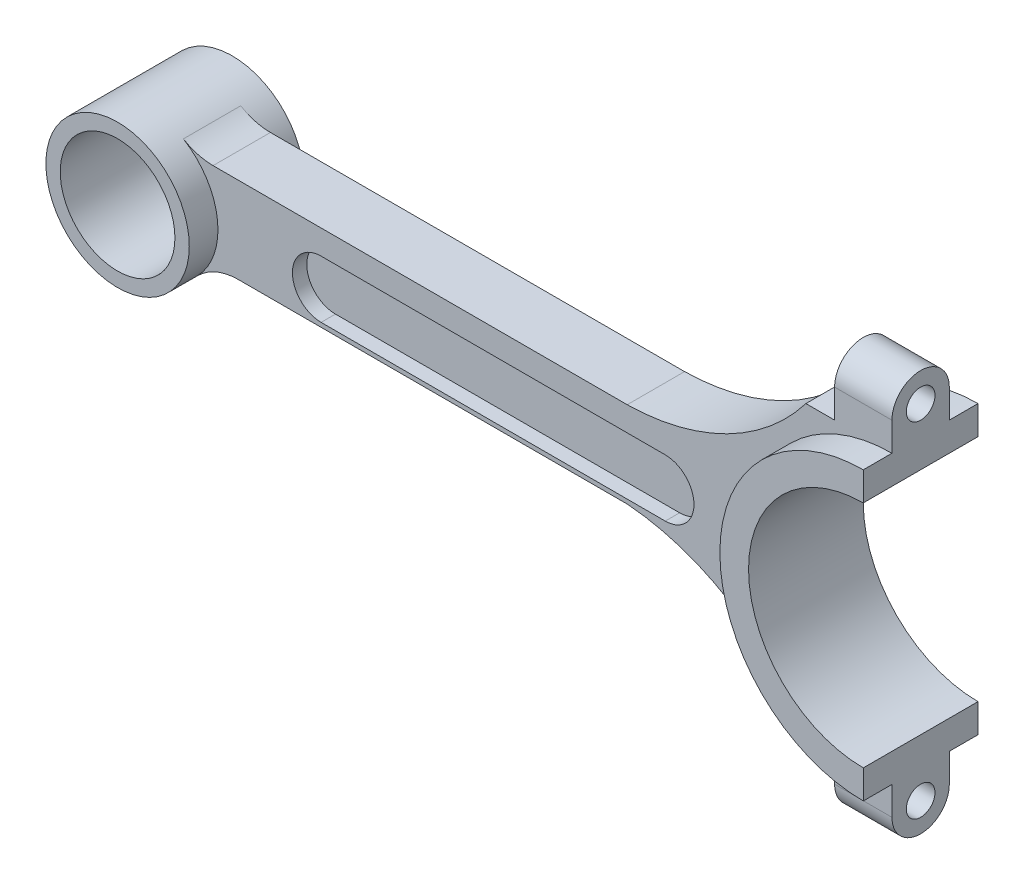
ISO-10303-21;
HEADER;
FILE_DESCRIPTION(('STEP AP214'),'2;1');
FILE_NAME('part.step','',(''),(''),'','','');
FILE_SCHEMA(('AUTOMOTIVE_DESIGN { 1 0 10303 214 1 1 1 1 }'));
ENDSEC;
DATA;
#1=APPLICATION_CONTEXT('core data for automotive mechanical design processes');
#2=APPLICATION_PROTOCOL_DEFINITION('international standard','automotive_design',2000,#1);
#3=PRODUCT_CONTEXT('',#1,'mechanical');
#4=PRODUCT('Part','Part','',(#3));
#5=PRODUCT_RELATED_PRODUCT_CATEGORY('part','',(#4));
#6=PRODUCT_DEFINITION_FORMATION('','',#4);
#7=PRODUCT_DEFINITION_CONTEXT('part definition',#1,'design');
#8=PRODUCT_DEFINITION('design','',#6,#7);
#9=PRODUCT_DEFINITION_SHAPE('','',#8);
#10=(LENGTH_UNIT() NAMED_UNIT(*) SI_UNIT(.MILLI.,.METRE.));
#11=(NAMED_UNIT(*) PLANE_ANGLE_UNIT() SI_UNIT($,.RADIAN.));
#12=(NAMED_UNIT(*) SI_UNIT($,.STERADIAN.) SOLID_ANGLE_UNIT());
#13=UNCERTAINTY_MEASURE_WITH_UNIT(LENGTH_MEASURE(1.E-05),#10,'distance_accuracy_value','');
#14=(GEOMETRIC_REPRESENTATION_CONTEXT(3) GLOBAL_UNCERTAINTY_ASSIGNED_CONTEXT((#13)) GLOBAL_UNIT_ASSIGNED_CONTEXT((#10,
#11,#12)) REPRESENTATION_CONTEXT('',''));
#15=CARTESIAN_POINT('',(0.,0.,0.));
#16=DIRECTION('',(0.,0.,1.));
#17=DIRECTION('',(1.,0.,0.));
#18=AXIS2_PLACEMENT_3D('',#15,#16,#17);
#19=CARTESIAN_POINT('',(0.,-31.7499999999999,6.35));
#20=DIRECTION('',(0.,-1.,0.));
#21=DIRECTION('',(1.,0.,0.));
#22=AXIS2_PLACEMENT_3D('',#19,#20,#21);
#23=PLANE('',#22);
#24=DIRECTION('',(-1.,0.,0.));
#25=VECTOR('',#24,1.);
#26=CARTESIAN_POINT('',(0.,-31.7499999999999,-6.35));
#27=LINE('',#26,#25);
#28=CARTESIAN_POINT('',(152.4,-31.75,-6.35));
#29=VERTEX_POINT('',#28);
#30=CARTESIAN_POINT('',(146.05,-31.75,-6.35));
#31=VERTEX_POINT('',#30);
#32=EDGE_CURVE('E423',#29,#31,#27,.T.);
#33=ORIENTED_EDGE('',*,*,#32,.F.);
#34=DIRECTION('',(0.,0.,-1.));
#35=VECTOR('',#34,1.);
#36=CARTESIAN_POINT('',(152.4,-31.75,0.));
#37=LINE('',#36,#35);
#38=CARTESIAN_POINT('',(152.4,-31.75,6.35));
#39=VERTEX_POINT('',#38);
#40=EDGE_CURVE('E233',#39,#29,#37,.T.);
#41=ORIENTED_EDGE('',*,*,#40,.F.);
#42=DIRECTION('',(-1.,0.,0.));
#43=VECTOR('',#42,1.);
#44=CARTESIAN_POINT('',(0.,-31.7499999999999,6.35));
#45=LINE('',#44,#43);
#46=CARTESIAN_POINT('',(146.05,-31.75,6.35));
#47=VERTEX_POINT('',#46);
#48=EDGE_CURVE('E248',#39,#47,#45,.T.);
#49=ORIENTED_EDGE('',*,*,#48,.T.);
#50=DIRECTION('',(0.,0.,-1.));
#51=VECTOR('',#50,1.);
#52=CARTESIAN_POINT('',(146.05,-31.75,6.35));
#53=LINE('',#52,#51);
#54=EDGE_CURVE('E397',#47,#31,#53,.T.);
#55=ORIENTED_EDGE('',*,*,#54,.T.);
#56=EDGE_LOOP('',(#33,#41,#49,#55));
#57=FACE_BOUND('',#56,.T.);
#58=ADVANCED_FACE('F36',(#57),#23,.T.);
#59=CARTESIAN_POINT('',(0.,31.7500000000001,6.35));
#60=DIRECTION('',(0.,1.,0.));
#61=DIRECTION('',(-1.,0.,0.));
#62=AXIS2_PLACEMENT_3D('',#59,#60,#61);
#63=PLANE('',#62);
#64=DIRECTION('',(1.,0.,0.));
#65=VECTOR('',#64,1.);
#66=CARTESIAN_POINT('',(0.,31.7500000000001,6.35));
#67=LINE('',#66,#65);
#68=CARTESIAN_POINT('',(146.05,31.75,6.35));
#69=VERTEX_POINT('',#68);
#70=CARTESIAN_POINT('',(152.4,31.75,6.35));
#71=VERTEX_POINT('',#70);
#72=EDGE_CURVE('E53',#69,#71,#67,.T.);
#73=ORIENTED_EDGE('',*,*,#72,.T.);
#74=DIRECTION('',(0.,0.,1.));
#75=VECTOR('',#74,1.);
#76=CARTESIAN_POINT('',(152.4,31.75,0.));
#77=LINE('',#76,#75);
#78=CARTESIAN_POINT('',(152.4,31.75,-6.35));
#79=VERTEX_POINT('',#78);
#80=EDGE_CURVE('E58',#79,#71,#77,.T.);
#81=ORIENTED_EDGE('',*,*,#80,.F.);
#82=DIRECTION('',(1.,0.,0.));
#83=VECTOR('',#82,1.);
#84=CARTESIAN_POINT('',(0.,31.7500000000001,-6.35));
#85=LINE('',#84,#83);
#86=CARTESIAN_POINT('',(146.05,31.75,-6.35));
#87=VERTEX_POINT('',#86);
#88=EDGE_CURVE('E400',#87,#79,#85,.T.);
#89=ORIENTED_EDGE('',*,*,#88,.F.);
#90=DIRECTION('',(0.,0.,-1.));
#91=VECTOR('',#90,1.);
#92=CARTESIAN_POINT('',(146.05,31.75,6.35));
#93=LINE('',#92,#91);
#94=EDGE_CURVE('E40',#69,#87,#93,.T.);
#95=ORIENTED_EDGE('',*,*,#94,.F.);
#96=EDGE_LOOP('',(#73,#81,#89,#95));
#97=FACE_BOUND('',#96,.T.);
#98=ADVANCED_FACE('F38',(#97),#63,.T.);
#99=CARTESIAN_POINT('',(114.912408675452,0.,6.35));
#100=DIRECTION('',(0.,0.,-1.));
#101=DIRECTION('',(-1.,0.,0.));
#102=AXIS2_PLACEMENT_3D('',#99,#100,#101);
#103=CYLINDRICAL_SURFACE('',#102,6.35);
#104=DIRECTION('',(0.,0.,-1.));
#105=VECTOR('',#104,1.);
#106=CARTESIAN_POINT('',(114.912408675452,-6.35,6.35));
#107=LINE('',#106,#105);
#108=CARTESIAN_POINT('',(114.912408675452,-6.35,-3.175));
#109=VERTEX_POINT('',#108);
#110=CARTESIAN_POINT('',(114.912408675452,-6.35,-6.35));
#111=VERTEX_POINT('',#110);
#112=EDGE_CURVE('E45',#109,#111,#107,.T.);
#113=ORIENTED_EDGE('',*,*,#112,.F.);
#114=CARTESIAN_POINT('',(114.912408675452,0.,-3.175));
#115=DIRECTION('',(0.,0.,1.));
#116=DIRECTION('',(1.,0.,0.));
#117=AXIS2_PLACEMENT_3D('',#114,#115,#116);
#118=CIRCLE('',#117,6.35);
#119=CARTESIAN_POINT('',(114.912408675452,6.35,-3.175));
#120=VERTEX_POINT('',#119);
#121=EDGE_CURVE('E307',#109,#120,#118,.T.);
#122=ORIENTED_EDGE('',*,*,#121,.T.);
#123=DIRECTION('',(0.,0.,-1.));
#124=VECTOR('',#123,1.);
#125=CARTESIAN_POINT('',(114.912408675452,6.35,6.35));
#126=LINE('',#125,#124);
#127=CARTESIAN_POINT('',(114.912408675452,6.35,-6.35));
#128=VERTEX_POINT('',#127);
#129=EDGE_CURVE('E440',#120,#128,#126,.T.);
#130=ORIENTED_EDGE('',*,*,#129,.T.);
#131=CARTESIAN_POINT('',(114.912408675452,0.,-6.35));
#132=DIRECTION('',(0.,0.,1.));
#133=DIRECTION('',(1.,0.,0.));
#134=AXIS2_PLACEMENT_3D('',#131,#132,#133);
#135=CIRCLE('',#134,6.35);
#136=EDGE_CURVE('E425',#111,#128,#135,.T.);
#137=ORIENTED_EDGE('',*,*,#136,.F.);
#138=EDGE_LOOP('',(#113,#122,#130,#137));
#139=FACE_BOUND('',#138,.T.);
#140=ADVANCED_FACE('F468',(#139),#103,.F.);
#141=CARTESIAN_POINT('',(0.,-6.35,6.35));
#142=DIRECTION('',(0.,1.,0.));
#143=DIRECTION('',(0.,0.,1.));
#144=AXIS2_PLACEMENT_3D('',#141,#142,#143);
#145=PLANE('',#144);
#146=DIRECTION('',(0.,0.,-1.));
#147=VECTOR('',#146,1.);
#148=CARTESIAN_POINT('',(38.7124086754516,-6.35,6.35));
#149=LINE('',#148,#147);
#150=CARTESIAN_POINT('',(38.7124086754516,-6.35,-3.175));
#151=VERTEX_POINT('',#150);
#152=CARTESIAN_POINT('',(38.7124086754516,-6.35,-6.35));
#153=VERTEX_POINT('',#152);
#154=EDGE_CURVE('E444',#151,#153,#149,.T.);
#155=ORIENTED_EDGE('',*,*,#154,.F.);
#156=DIRECTION('',(1.,0.,0.));
#157=VECTOR('',#156,1.);
#158=CARTESIAN_POINT('',(0.,-6.35,-3.175));
#159=LINE('',#158,#157);
#160=EDGE_CURVE('E293',#151,#109,#159,.T.);
#161=ORIENTED_EDGE('',*,*,#160,.T.);
#162=ORIENTED_EDGE('',*,*,#112,.T.);
#163=DIRECTION('',(1.,0.,0.));
#164=VECTOR('',#163,1.);
#165=CARTESIAN_POINT('',(0.,-6.35,-6.35));
#166=LINE('',#165,#164);
#167=EDGE_CURVE('E428',#153,#111,#166,.T.);
#168=ORIENTED_EDGE('',*,*,#167,.F.);
#169=EDGE_LOOP('',(#155,#161,#162,#168));
#170=FACE_BOUND('',#169,.T.);
#171=ADVANCED_FACE('F480',(#170),#145,.T.);
#172=CARTESIAN_POINT('',(38.7124086754516,0.,6.35));
#173=DIRECTION('',(0.,0.,-1.));
#174=DIRECTION('',(-1.,0.,0.));
#175=AXIS2_PLACEMENT_3D('',#172,#173,#174);
#176=CYLINDRICAL_SURFACE('',#175,6.35);
#177=DIRECTION('',(0.,0.,-1.));
#178=VECTOR('',#177,1.);
#179=CARTESIAN_POINT('',(38.7124086754516,6.35,6.35));
#180=LINE('',#179,#178);
#181=CARTESIAN_POINT('',(38.7124086754516,6.35,-3.175));
#182=VERTEX_POINT('',#181);
#183=CARTESIAN_POINT('',(38.7124086754516,6.35,-6.35));
#184=VERTEX_POINT('',#183);
#185=EDGE_CURVE('E439',#182,#184,#180,.T.);
#186=ORIENTED_EDGE('',*,*,#185,.F.);
#187=CARTESIAN_POINT('',(38.7124086754516,0.,-3.175));
#188=DIRECTION('',(0.,0.,1.));
#189=DIRECTION('',(1.,0.,0.));
#190=AXIS2_PLACEMENT_3D('',#187,#188,#189);
#191=CIRCLE('',#190,6.35);
#192=EDGE_CURVE('E298',#182,#151,#191,.T.);
#193=ORIENTED_EDGE('',*,*,#192,.T.);
#194=ORIENTED_EDGE('',*,*,#154,.T.);
#195=CARTESIAN_POINT('',(38.7124086754516,0.,-6.35));
#196=DIRECTION('',(0.,0.,1.));
#197=DIRECTION('',(1.,0.,0.));
#198=AXIS2_PLACEMENT_3D('',#195,#196,#197);
#199=CIRCLE('',#198,6.35);
#200=EDGE_CURVE('E431',#184,#153,#199,.T.);
#201=ORIENTED_EDGE('',*,*,#200,.F.);
#202=EDGE_LOOP('',(#186,#193,#194,#201));
#203=FACE_BOUND('',#202,.T.);
#204=ADVANCED_FACE('F486',(#203),#176,.F.);
#205=CARTESIAN_POINT('',(0.,6.35,6.35));
#206=DIRECTION('',(0.,1.,0.));
#207=DIRECTION('',(0.,0.,1.));
#208=AXIS2_PLACEMENT_3D('',#205,#206,#207);
#209=PLANE('',#208);
#210=DIRECTION('',(1.,0.,0.));
#211=VECTOR('',#210,1.);
#212=CARTESIAN_POINT('',(0.,6.35,-3.175));
#213=LINE('',#212,#211);
#214=EDGE_CURVE('E310',#182,#120,#213,.T.);
#215=ORIENTED_EDGE('',*,*,#214,.F.);
#216=ORIENTED_EDGE('',*,*,#185,.T.);
#217=DIRECTION('',(1.,0.,0.));
#218=VECTOR('',#217,1.);
#219=CARTESIAN_POINT('',(0.,6.35,-6.35));
#220=LINE('',#219,#218);
#221=EDGE_CURVE('E363',#184,#128,#220,.T.);
#222=ORIENTED_EDGE('',*,*,#221,.T.);
#223=ORIENTED_EDGE('',*,*,#129,.F.);
#224=EDGE_LOOP('',(#215,#216,#222,#223));
#225=FACE_BOUND('',#224,.T.);
#226=ADVANCED_FACE('F472',(#225),#209,.F.);
#227=CARTESIAN_POINT('',(114.912408675452,0.,3.175));
#228=DIRECTION('',(0.,0.,1.));
#229=DIRECTION('',(1.,0.,0.));
#230=AXIS2_PLACEMENT_3D('',#227,#228,#229);
#231=CIRCLE('',#230,6.35);
#232=CARTESIAN_POINT('',(114.912408675452,-6.35,3.175));
#233=VERTEX_POINT('',#232);
#234=CARTESIAN_POINT('',(114.912408675452,6.35,3.175));
#235=VERTEX_POINT('',#234);
#236=EDGE_CURVE('E297',#233,#235,#231,.T.);
#237=ORIENTED_EDGE('',*,*,#236,.F.);
#238=CARTESIAN_POINT('',(114.912408675452,-6.35,6.35));
#239=VERTEX_POINT('',#238);
#240=EDGE_CURVE('E11',#239,#233,#107,.T.);
#241=ORIENTED_EDGE('',*,*,#240,.F.);
#242=CARTESIAN_POINT('',(114.912408675452,0.,6.35));
#243=DIRECTION('',(0.,0.,1.));
#244=DIRECTION('',(1.,0.,0.));
#245=AXIS2_PLACEMENT_3D('',#242,#243,#244);
#246=CIRCLE('',#245,6.35);
#247=CARTESIAN_POINT('',(114.912408675452,6.35,6.35));
#248=VERTEX_POINT('',#247);
#249=EDGE_CURVE('E386',#239,#248,#246,.T.);
#250=ORIENTED_EDGE('',*,*,#249,.T.);
#251=EDGE_CURVE('E436',#248,#235,#126,.T.);
#252=ORIENTED_EDGE('',*,*,#251,.T.);
#253=EDGE_LOOP('',(#237,#241,#250,#252));
#254=FACE_BOUND('',#253,.T.);
#255=ADVANCED_FACE('F494',(#254),#103,.F.);
#256=DIRECTION('',(1.,0.,0.));
#257=VECTOR('',#256,1.);
#258=CARTESIAN_POINT('',(0.,-6.35,3.175));
#259=LINE('',#258,#257);
#260=CARTESIAN_POINT('',(38.7124086754516,-6.35,3.175));
#261=VERTEX_POINT('',#260);
#262=EDGE_CURVE('E295',#261,#233,#259,.T.);
#263=ORIENTED_EDGE('',*,*,#262,.F.);
#264=CARTESIAN_POINT('',(38.7124086754516,-6.35,6.35));
#265=VERTEX_POINT('',#264);
#266=EDGE_CURVE('E445',#265,#261,#149,.T.);
#267=ORIENTED_EDGE('',*,*,#266,.F.);
#268=DIRECTION('',(1.,0.,0.));
#269=VECTOR('',#268,1.);
#270=CARTESIAN_POINT('',(0.,-6.35,6.35));
#271=LINE('',#270,#269);
#272=EDGE_CURVE('E389',#265,#239,#271,.T.);
#273=ORIENTED_EDGE('',*,*,#272,.T.);
#274=ORIENTED_EDGE('',*,*,#240,.T.);
#275=EDGE_LOOP('',(#263,#267,#273,#274));
#276=FACE_BOUND('',#275,.T.);
#277=ADVANCED_FACE('F498',(#276),#145,.T.);
#278=CARTESIAN_POINT('',(38.7124086754516,0.,3.175));
#279=DIRECTION('',(0.,0.,1.));
#280=DIRECTION('',(1.,0.,0.));
#281=AXIS2_PLACEMENT_3D('',#278,#279,#280);
#282=CIRCLE('',#281,6.35);
#283=CARTESIAN_POINT('',(38.7124086754516,6.35,3.175));
#284=VERTEX_POINT('',#283);
#285=EDGE_CURVE('E303',#284,#261,#282,.T.);
#286=ORIENTED_EDGE('',*,*,#285,.F.);
#287=CARTESIAN_POINT('',(38.7124086754516,6.35,6.35));
#288=VERTEX_POINT('',#287);
#289=EDGE_CURVE('E441',#288,#284,#180,.T.);
#290=ORIENTED_EDGE('',*,*,#289,.F.);
#291=CARTESIAN_POINT('',(38.7124086754516,0.,6.35));
#292=DIRECTION('',(0.,0.,1.));
#293=DIRECTION('',(1.,0.,0.));
#294=AXIS2_PLACEMENT_3D('',#291,#292,#293);
#295=CIRCLE('',#294,6.35);
#296=EDGE_CURVE('E392',#288,#265,#295,.T.);
#297=ORIENTED_EDGE('',*,*,#296,.T.);
#298=ORIENTED_EDGE('',*,*,#266,.T.);
#299=EDGE_LOOP('',(#286,#290,#297,#298));
#300=FACE_BOUND('',#299,.T.);
#301=ADVANCED_FACE('F489',(#300),#176,.F.);
#302=CARTESIAN_POINT('',(105.649529916631,62.5311230584765,6.35));
#303=DIRECTION('',(0.,0.,-1.));
#304=DIRECTION('',(-1.,0.,0.));
#305=AXIS2_PLACEMENT_3D('',#302,#303,#304);
#306=CYLINDRICAL_SURFACE('',#305,50.7905061965151);
#307=CARTESIAN_POINT('',(105.649529916631,62.5311230584765,-6.35));
#308=DIRECTION('',(0.,0.,1.));
#309=DIRECTION('',(1.,0.,0.));
#310=AXIS2_PLACEMENT_3D('',#307,#308,#309);
#311=CIRCLE('',#310,50.7905061965151);
#312=CARTESIAN_POINT('',(106.485681070918,11.7475,-6.35));
#313=VERTEX_POINT('',#312);
#314=EDGE_CURVE('E402',#313,#87,#311,.T.);
#315=ORIENTED_EDGE('',*,*,#314,.F.);
#316=DIRECTION('',(0.,0.,-1.));
#317=VECTOR('',#316,1.);
#318=CARTESIAN_POINT('',(106.485681070918,11.7475,6.35));
#319=LINE('',#318,#317);
#320=CARTESIAN_POINT('',(106.485681070918,11.7475,6.35));
#321=VERTEX_POINT('',#320);
#322=EDGE_CURVE('E460',#321,#313,#319,.T.);
#323=ORIENTED_EDGE('',*,*,#322,.F.);
#324=CARTESIAN_POINT('',(105.649529916631,62.5311230584765,6.35));
#325=DIRECTION('',(0.,0.,1.));
#326=DIRECTION('',(1.,0.,0.));
#327=AXIS2_PLACEMENT_3D('',#324,#325,#326);
#328=CIRCLE('',#327,50.7905061965151);
#329=EDGE_CURVE('E365',#321,#69,#328,.T.);
#330=ORIENTED_EDGE('',*,*,#329,.T.);
#331=ORIENTED_EDGE('',*,*,#94,.T.);
#332=EDGE_LOOP('',(#315,#323,#330,#331));
#333=FACE_BOUND('',#332,.T.);
#334=ADVANCED_FACE('F500',(#333),#306,.F.);
#335=CARTESIAN_POINT('',(0.,11.7475,6.35));
#336=DIRECTION('',(0.,1.,0.));
#337=DIRECTION('',(-1.,0.,0.));
#338=AXIS2_PLACEMENT_3D('',#335,#336,#337);
#339=PLANE('',#338);
#340=DIRECTION('',(1.,0.,0.));
#341=VECTOR('',#340,1.);
#342=CARTESIAN_POINT('',(0.,11.7475,-6.35));
#343=LINE('',#342,#341);
#344=CARTESIAN_POINT('',(14.7935921516716,11.7475,-6.35));
#345=VERTEX_POINT('',#344);
#346=EDGE_CURVE('E405',#345,#313,#343,.T.);
#347=ORIENTED_EDGE('',*,*,#346,.F.);
#348=DIRECTION('',(0.,0.,-1.));
#349=VECTOR('',#348,1.);
#350=CARTESIAN_POINT('',(14.7935921516716,11.7475,6.35));
#351=LINE('',#350,#349);
#352=CARTESIAN_POINT('',(14.7935921516716,11.7475,6.35));
#353=VERTEX_POINT('',#352);
#354=EDGE_CURVE('E459',#353,#345,#351,.T.);
#355=ORIENTED_EDGE('',*,*,#354,.F.);
#356=DIRECTION('',(1.,0.,0.));
#357=VECTOR('',#356,1.);
#358=CARTESIAN_POINT('',(0.,11.7475,6.35));
#359=LINE('',#358,#357);
#360=EDGE_CURVE('E368',#353,#321,#359,.T.);
#361=ORIENTED_EDGE('',*,*,#360,.T.);
#362=ORIENTED_EDGE('',*,*,#322,.T.);
#363=EDGE_LOOP('',(#347,#355,#361,#362));
#364=FACE_BOUND('',#363,.T.);
#365=ADVANCED_FACE('F526',(#364),#339,.T.);
#366=CARTESIAN_POINT('',(14.7935921516716,24.4475,6.35));
#367=DIRECTION('',(0.,0.,-1.));
#368=DIRECTION('',(-1.,0.,0.));
#369=AXIS2_PLACEMENT_3D('',#366,#367,#368);
#370=CYLINDRICAL_SURFACE('',#369,12.7);
#371=CARTESIAN_POINT('',(14.7935921516716,24.4475,-6.35));
#372=DIRECTION('',(0.,0.,1.));
#373=DIRECTION('',(1.,0.,0.));
#374=AXIS2_PLACEMENT_3D('',#371,#372,#373);
#375=CIRCLE('',#374,12.7);
#376=CARTESIAN_POINT('',(8.21866230648424,13.5819444444444,-6.35));
#377=VERTEX_POINT('',#376);
#378=EDGE_CURVE('E408',#377,#345,#375,.T.);
#379=ORIENTED_EDGE('',*,*,#378,.F.);
#380=DIRECTION('',(0.,0.,-1.));
#381=VECTOR('',#380,1.);
#382=CARTESIAN_POINT('',(8.21866230648424,13.5819444444444,6.35));
#383=LINE('',#382,#381);
#384=CARTESIAN_POINT('',(8.21866230648424,13.5819444444444,6.35));
#385=VERTEX_POINT('',#384);
#386=EDGE_CURVE('E457',#385,#377,#383,.T.);
#387=ORIENTED_EDGE('',*,*,#386,.F.);
#388=CARTESIAN_POINT('',(14.7935921516716,24.4475,6.35));
#389=DIRECTION('',(0.,0.,1.));
#390=DIRECTION('',(1.,0.,0.));
#391=AXIS2_PLACEMENT_3D('',#388,#389,#390);
#392=CIRCLE('',#391,12.7);
#393=EDGE_CURVE('E371',#385,#353,#392,.T.);
#394=ORIENTED_EDGE('',*,*,#393,.T.);
#395=ORIENTED_EDGE('',*,*,#354,.T.);
#396=EDGE_LOOP('',(#379,#387,#394,#395));
#397=FACE_BOUND('',#396,.T.);
#398=ADVANCED_FACE('F522',(#397),#370,.F.);
#399=CARTESIAN_POINT('',(20.4066317345612,-20.0025,6.35));
#400=DIRECTION('',(0.,0.,-1.));
#401=DIRECTION('',(-1.,0.,0.));
#402=AXIS2_PLACEMENT_3D('',#399,#400,#401);
#403=CYLINDRICAL_SURFACE('',#402,12.7);
#404=CARTESIAN_POINT('',(20.4066317345612,-20.0025,-6.35));
#405=DIRECTION('',(0.,0.,1.));
#406=DIRECTION('',(1.,0.,0.));
#407=AXIS2_PLACEMENT_3D('',#404,#405,#406);
#408=CIRCLE('',#407,12.7);
#409=CARTESIAN_POINT('',(20.4066317345612,-7.30250000000001,-6.35));
#410=VERTEX_POINT('',#409);
#411=CARTESIAN_POINT('',(11.3370176303118,-11.1125,-6.35));
#412=VERTEX_POINT('',#411);
#413=EDGE_CURVE('E414',#410,#412,#408,.T.);
#414=ORIENTED_EDGE('',*,*,#413,.F.);
#415=DIRECTION('',(0.,0.,-1.));
#416=VECTOR('',#415,1.);
#417=CARTESIAN_POINT('',(20.4066317345612,-7.30250000000001,6.35));
#418=LINE('',#417,#416);
#419=CARTESIAN_POINT('',(20.4066317345612,-7.30250000000001,6.35));
#420=VERTEX_POINT('',#419);
#421=EDGE_CURVE('E452',#420,#410,#418,.T.);
#422=ORIENTED_EDGE('',*,*,#421,.F.);
#423=CARTESIAN_POINT('',(20.4066317345612,-20.0025,6.35));
#424=DIRECTION('',(0.,0.,1.));
#425=DIRECTION('',(1.,0.,0.));
#426=AXIS2_PLACEMENT_3D('',#423,#424,#425);
#427=CIRCLE('',#426,12.7);
#428=CARTESIAN_POINT('',(11.3370176303118,-11.1125,6.35));
#429=VERTEX_POINT('',#428);
#430=EDGE_CURVE('E376',#420,#429,#427,.T.);
#431=ORIENTED_EDGE('',*,*,#430,.T.);
#432=DIRECTION('',(0.,0.,-1.));
#433=VECTOR('',#432,1.);
#434=CARTESIAN_POINT('',(11.3370176303118,-11.1125,6.35));
#435=LINE('',#434,#433);
#436=EDGE_CURVE('E454',#429,#412,#435,.T.);
#437=ORIENTED_EDGE('',*,*,#436,.T.);
#438=EDGE_LOOP('',(#414,#422,#431,#437));
#439=FACE_BOUND('',#438,.T.);
#440=ADVANCED_FACE('F518',(#439),#403,.F.);
#441=CARTESIAN_POINT('',(0.,-7.30250000000001,6.35));
#442=DIRECTION('',(0.,-1.,0.));
#443=DIRECTION('',(1.,0.,0.));
#444=AXIS2_PLACEMENT_3D('',#441,#442,#443);
#445=PLANE('',#444);
#446=DIRECTION('',(-1.,0.,0.));
#447=VECTOR('',#446,1.);
#448=CARTESIAN_POINT('',(0.,-7.30250000000001,-6.35));
#449=LINE('',#448,#447);
#450=CARTESIAN_POINT('',(106.481936539914,-7.3025,-6.35));
#451=VERTEX_POINT('',#450);
#452=EDGE_CURVE('E417',#451,#410,#449,.T.);
#453=ORIENTED_EDGE('',*,*,#452,.F.);
#454=DIRECTION('',(0.,0.,-1.));
#455=VECTOR('',#454,1.);
#456=CARTESIAN_POINT('',(106.481936539914,-7.3025,6.35));
#457=LINE('',#456,#455);
#458=CARTESIAN_POINT('',(106.481936539914,-7.3025,6.35));
#459=VERTEX_POINT('',#458);
#460=EDGE_CURVE('E450',#459,#451,#457,.T.);
#461=ORIENTED_EDGE('',*,*,#460,.F.);
#462=DIRECTION('',(-1.,0.,0.));
#463=VECTOR('',#462,1.);
#464=CARTESIAN_POINT('',(0.,-7.30250000000001,6.35));
#465=LINE('',#464,#463);
#466=EDGE_CURVE('E379',#459,#420,#465,.T.);
#467=ORIENTED_EDGE('',*,*,#466,.T.);
#468=ORIENTED_EDGE('',*,*,#421,.T.);
#469=EDGE_LOOP('',(#453,#461,#467,#468));
#470=FACE_BOUND('',#469,.T.);
#471=ADVANCED_FACE('F514',(#470),#445,.T.);
#472=CARTESIAN_POINT('',(102.532168972932,-57.9391951573215,6.35));
#473=DIRECTION('',(0.,0.,-1.));
#474=DIRECTION('',(-1.,0.,0.));
#475=AXIS2_PLACEMENT_3D('',#472,#473,#474);
#476=CYLINDRICAL_SURFACE('',#475,50.7905065961021);
#477=CARTESIAN_POINT('',(102.532168972932,-57.9391951573215,-6.35));
#478=DIRECTION('',(0.,0.,1.));
#479=DIRECTION('',(1.,0.,0.));
#480=AXIS2_PLACEMENT_3D('',#477,#478,#479);
#481=CIRCLE('',#480,50.7905065961021);
#482=EDGE_CURVE('E420',#31,#451,#481,.T.);
#483=ORIENTED_EDGE('',*,*,#482,.F.);
#484=ORIENTED_EDGE('',*,*,#54,.F.);
#485=CARTESIAN_POINT('',(102.532168972932,-57.9391951573215,6.35));
#486=DIRECTION('',(0.,0.,1.));
#487=DIRECTION('',(1.,0.,0.));
#488=AXIS2_PLACEMENT_3D('',#485,#486,#487);
#489=CIRCLE('',#488,50.7905065961021);
#490=EDGE_CURVE('E382',#47,#459,#489,.T.);
#491=ORIENTED_EDGE('',*,*,#490,.T.);
#492=ORIENTED_EDGE('',*,*,#460,.T.);
#493=EDGE_LOOP('',(#483,#484,#491,#492));
#494=FACE_BOUND('',#493,.T.);
#495=ADVANCED_FACE('F511',(#494),#476,.F.);
#496=ORIENTED_EDGE('',*,*,#289,.T.);
#497=DIRECTION('',(1.,0.,0.));
#498=VECTOR('',#497,1.);
#499=CARTESIAN_POINT('',(0.,6.35,3.175));
#500=LINE('',#499,#498);
#501=EDGE_CURVE('E300',#284,#235,#500,.T.);
#502=ORIENTED_EDGE('',*,*,#501,.T.);
#503=ORIENTED_EDGE('',*,*,#251,.F.);
#504=DIRECTION('',(1.,0.,0.));
#505=VECTOR('',#504,1.);
#506=CARTESIAN_POINT('',(0.,6.35,6.35));
#507=LINE('',#506,#505);
#508=EDGE_CURVE('E395',#288,#248,#507,.T.);
#509=ORIENTED_EDGE('',*,*,#508,.F.);
#510=EDGE_LOOP('',(#496,#502,#503,#509));
#511=FACE_BOUND('',#510,.T.);
#512=ADVANCED_FACE('F496',(#511),#209,.F.);
#513=CARTESIAN_POINT('',(0.,0.,6.35));
#514=DIRECTION('',(0.,0.,1.));
#515=DIRECTION('',(1.,0.,0.));
#516=AXIS2_PLACEMENT_3D('',#513,#514,#515);
#517=PLANE('',#516);
#518=CARTESIAN_POINT('',(165.1,0.,6.35));
#519=DIRECTION('',(0.,0.,1.));
#520=DIRECTION('',(1.,0.,0.));
#521=AXIS2_PLACEMENT_3D('',#518,#519,#520);
#522=CIRCLE('',#521,31.75);
#523=CARTESIAN_POINT('',(165.1,31.75,6.35));
#524=VERTEX_POINT('',#523);
#525=CARTESIAN_POINT('',(165.1,-31.75,6.35));
#526=VERTEX_POINT('',#525);
#527=EDGE_CURVE('E360',#524,#526,#522,.T.);
#528=ORIENTED_EDGE('',*,*,#527,.F.);
#529=DIRECTION('',(0.,1.,0.));
#530=VECTOR('',#529,1.);
#531=CARTESIAN_POINT('',(165.1,0.,6.35));
#532=LINE('',#531,#530);
#533=CARTESIAN_POINT('',(165.1,38.0851254644642,6.35));
#534=VERTEX_POINT('',#533);
#535=EDGE_CURVE('E271',#524,#534,#532,.T.);
#536=ORIENTED_EDGE('',*,*,#535,.T.);
#537=DIRECTION('',(1.,0.,0.));
#538=VECTOR('',#537,1.);
#539=CARTESIAN_POINT('',(152.4,38.0851254644642,6.35));
#540=LINE('',#539,#538);
#541=CARTESIAN_POINT('',(152.4,38.0851254644642,6.35));
#542=VERTEX_POINT('',#541);
#543=EDGE_CURVE('E291',#542,#534,#540,.T.);
#544=ORIENTED_EDGE('',*,*,#543,.F.);
#545=DIRECTION('',(0.,1.,0.));
#546=VECTOR('',#545,1.);
#547=CARTESIAN_POINT('',(152.4,0.,6.35));
#548=LINE('',#547,#546);
#549=EDGE_CURVE('E277',#71,#542,#548,.T.);
#550=ORIENTED_EDGE('',*,*,#549,.F.);
#551=ORIENTED_EDGE('',*,*,#72,.F.);
#552=ORIENTED_EDGE('',*,*,#329,.F.);
#553=ORIENTED_EDGE('',*,*,#360,.F.);
#554=ORIENTED_EDGE('',*,*,#393,.F.);
#555=CARTESIAN_POINT('',(0.,0.,6.35));
#556=DIRECTION('',(0.,0.,1.));
#557=DIRECTION('',(1.,0.,0.));
#558=AXIS2_PLACEMENT_3D('',#555,#556,#557);
#559=CIRCLE('',#558,15.875);
#560=EDGE_CURVE('E374',#429,#385,#559,.T.);
#561=ORIENTED_EDGE('',*,*,#560,.F.);
#562=ORIENTED_EDGE('',*,*,#430,.F.);
#563=ORIENTED_EDGE('',*,*,#466,.F.);
#564=ORIENTED_EDGE('',*,*,#490,.F.);
#565=ORIENTED_EDGE('',*,*,#48,.F.);
#566=DIRECTION('',(0.,-1.,0.));
#567=VECTOR('',#566,1.);
#568=CARTESIAN_POINT('',(152.4,0.,6.35));
#569=LINE('',#568,#567);
#570=CARTESIAN_POINT('',(152.4,-38.0584346834333,6.35));
#571=VERTEX_POINT('',#570);
#572=EDGE_CURVE('E238',#39,#571,#569,.T.);
#573=ORIENTED_EDGE('',*,*,#572,.T.);
#574=DIRECTION('',(1.,0.,0.));
#575=VECTOR('',#574,1.);
#576=CARTESIAN_POINT('',(152.4,-38.0584346834333,6.35));
#577=LINE('',#576,#575);
#578=CARTESIAN_POINT('',(165.1,-38.0584346834333,6.35));
#579=VERTEX_POINT('',#578);
#580=EDGE_CURVE('E223',#571,#579,#577,.T.);
#581=ORIENTED_EDGE('',*,*,#580,.T.);
#582=DIRECTION('',(0.,-1.,0.));
#583=VECTOR('',#582,1.);
#584=CARTESIAN_POINT('',(165.1,0.,6.35));
#585=LINE('',#584,#583);
#586=EDGE_CURVE('E260',#526,#579,#585,.T.);
#587=ORIENTED_EDGE('',*,*,#586,.F.);
#588=EDGE_LOOP('',(#528,#536,#544,#550,#551,#552,#553,#554,#561,#562,#563,#564,#565,#573,#581,#587));
#589=FACE_BOUND('',#588,.T.);
#590=ORIENTED_EDGE('',*,*,#249,.F.);
#591=ORIENTED_EDGE('',*,*,#272,.F.);
#592=ORIENTED_EDGE('',*,*,#296,.F.);
#593=ORIENTED_EDGE('',*,*,#508,.T.);
#594=EDGE_LOOP('',(#590,#591,#592,#593));
#595=FACE_BOUND('',#594,.T.);
#596=ADVANCED_FACE('F245',(#589,#595),#517,.T.);
#597=CARTESIAN_POINT('',(0.,0.,-6.35));
#598=DIRECTION('',(0.,0.,1.));
#599=DIRECTION('',(1.,0.,0.));
#600=AXIS2_PLACEMENT_3D('',#597,#598,#599);
#601=PLANE('',#600);
#602=CARTESIAN_POINT('',(165.1,0.,-6.35));
#603=DIRECTION('',(0.,0.,1.));
#604=DIRECTION('',(1.,0.,0.));
#605=AXIS2_PLACEMENT_3D('',#602,#603,#604);
#606=CIRCLE('',#605,31.75);
#607=CARTESIAN_POINT('',(165.1,31.75,-6.35));
#608=VERTEX_POINT('',#607);
#609=CARTESIAN_POINT('',(165.1,-31.75,-6.35));
#610=VERTEX_POINT('',#609);
#611=EDGE_CURVE('E355',#608,#610,#606,.T.);
#612=ORIENTED_EDGE('',*,*,#611,.T.);
#613=DIRECTION('',(0.,-1.,0.));
#614=VECTOR('',#613,1.);
#615=CARTESIAN_POINT('',(165.1,0.,-6.35));
#616=LINE('',#615,#614);
#617=CARTESIAN_POINT('',(165.1,-38.0584346834333,-6.35));
#618=VERTEX_POINT('',#617);
#619=EDGE_CURVE('E252',#610,#618,#616,.T.);
#620=ORIENTED_EDGE('',*,*,#619,.T.);
#621=DIRECTION('',(1.,0.,0.));
#622=VECTOR('',#621,1.);
#623=CARTESIAN_POINT('',(152.4,-38.0584346834333,-6.35));
#624=LINE('',#623,#622);
#625=CARTESIAN_POINT('',(152.4,-38.0584346834333,-6.35));
#626=VERTEX_POINT('',#625);
#627=EDGE_CURVE('E232',#626,#618,#624,.T.);
#628=ORIENTED_EDGE('',*,*,#627,.F.);
#629=DIRECTION('',(0.,-1.,0.));
#630=VECTOR('',#629,1.);
#631=CARTESIAN_POINT('',(152.4,0.,-6.35));
#632=LINE('',#631,#630);
#633=EDGE_CURVE('E240',#29,#626,#632,.T.);
#634=ORIENTED_EDGE('',*,*,#633,.F.);
#635=ORIENTED_EDGE('',*,*,#32,.T.);
#636=ORIENTED_EDGE('',*,*,#482,.T.);
#637=ORIENTED_EDGE('',*,*,#452,.T.);
#638=ORIENTED_EDGE('',*,*,#413,.T.);
#639=CARTESIAN_POINT('',(0.,0.,-6.35));
#640=DIRECTION('',(0.,0.,1.));
#641=DIRECTION('',(1.,0.,0.));
#642=AXIS2_PLACEMENT_3D('',#639,#640,#641);
#643=CIRCLE('',#642,15.875);
#644=EDGE_CURVE('E411',#412,#377,#643,.T.);
#645=ORIENTED_EDGE('',*,*,#644,.T.);
#646=ORIENTED_EDGE('',*,*,#378,.T.);
#647=ORIENTED_EDGE('',*,*,#346,.T.);
#648=ORIENTED_EDGE('',*,*,#314,.T.);
#649=ORIENTED_EDGE('',*,*,#88,.T.);
#650=DIRECTION('',(0.,1.,0.));
#651=VECTOR('',#650,1.);
#652=CARTESIAN_POINT('',(152.4,0.,-6.34999999999996));
#653=LINE('',#652,#651);
#654=CARTESIAN_POINT('',(152.4,38.0851254644642,-6.34999999999999));
#655=VERTEX_POINT('',#654);
#656=EDGE_CURVE('E270',#79,#655,#653,.T.);
#657=ORIENTED_EDGE('',*,*,#656,.T.);
#658=DIRECTION('',(1.,0.,0.));
#659=VECTOR('',#658,1.);
#660=CARTESIAN_POINT('',(152.4,38.0851254644642,-6.34999999999999));
#661=LINE('',#660,#659);
#662=CARTESIAN_POINT('',(165.1,38.0851254644642,-6.34999999999999));
#663=VERTEX_POINT('',#662);
#664=EDGE_CURVE('E280',#655,#663,#661,.T.);
#665=ORIENTED_EDGE('',*,*,#664,.T.);
#666=DIRECTION('',(0.,1.,0.));
#667=VECTOR('',#666,1.);
#668=CARTESIAN_POINT('',(165.1,0.,-6.34999999999996));
#669=LINE('',#668,#667);
#670=EDGE_CURVE('E283',#608,#663,#669,.T.);
#671=ORIENTED_EDGE('',*,*,#670,.F.);
#672=EDGE_LOOP('',(#612,#620,#628,#634,#635,#636,#637,#638,#645,#646,#647,#648,#649,#657,#665,#671));
#673=FACE_BOUND('',#672,.T.);
#674=ORIENTED_EDGE('',*,*,#136,.T.);
#675=ORIENTED_EDGE('',*,*,#221,.F.);
#676=ORIENTED_EDGE('',*,*,#200,.T.);
#677=ORIENTED_EDGE('',*,*,#167,.T.);
#678=EDGE_LOOP('',(#674,#675,#676,#677));
#679=FACE_BOUND('',#678,.T.);
#680=ADVANCED_FACE('F476',(#673,#679),#601,.F.);
#681=CARTESIAN_POINT('',(0.,0.,12.7));
#682=DIRECTION('',(0.,0.,-1.));
#683=DIRECTION('',(-1.,0.,0.));
#684=AXIS2_PLACEMENT_3D('',#681,#682,#683);
#685=CYLINDRICAL_SURFACE('',#684,12.7);
#686=CARTESIAN_POINT('',(0.,0.,12.7));
#687=DIRECTION('',(0.,0.,1.));
#688=DIRECTION('',(1.,0.,0.));
#689=AXIS2_PLACEMENT_3D('',#686,#687,#688);
#690=CIRCLE('',#689,12.7);
#691=CARTESIAN_POINT('',(12.7,0.,12.7));
#692=VERTEX_POINT('',#691);
#693=EDGE_CURVE('E348',#692,#692,#690,.T.);
#694=ORIENTED_EDGE('',*,*,#693,.T.);
#695=EDGE_LOOP('',(#694));
#696=FACE_BOUND('',#695,.T.);
#697=CARTESIAN_POINT('',(0.,0.,-12.7));
#698=DIRECTION('',(0.,0.,1.));
#699=DIRECTION('',(1.,0.,0.));
#700=AXIS2_PLACEMENT_3D('',#697,#698,#699);
#701=CIRCLE('',#700,12.7);
#702=CARTESIAN_POINT('',(12.7,0.,-12.7));
#703=VERTEX_POINT('',#702);
#704=EDGE_CURVE('E347',#703,#703,#701,.T.);
#705=ORIENTED_EDGE('',*,*,#704,.F.);
#706=EDGE_LOOP('',(#705));
#707=FACE_BOUND('',#706,.T.);
#708=ADVANCED_FACE('F612',(#696,#707),#685,.F.);
#709=CARTESIAN_POINT('',(0.,0.,12.7));
#710=DIRECTION('',(0.,0.,-1.));
#711=DIRECTION('',(-1.,0.,0.));
#712=AXIS2_PLACEMENT_3D('',#709,#710,#711);
#713=CYLINDRICAL_SURFACE('',#712,15.875);
#714=ORIENTED_EDGE('',*,*,#560,.T.);
#715=ORIENTED_EDGE('',*,*,#386,.T.);
#716=ORIENTED_EDGE('',*,*,#644,.F.);
#717=ORIENTED_EDGE('',*,*,#436,.F.);
#718=EDGE_LOOP('',(#714,#715,#716,#717));
#719=FACE_BOUND('',#718,.T.);
#720=CARTESIAN_POINT('',(0.,0.,12.7));
#721=DIRECTION('',(0.,0.,1.));
#722=DIRECTION('',(1.,0.,0.));
#723=AXIS2_PLACEMENT_3D('',#720,#721,#722);
#724=CIRCLE('',#723,15.875);
#725=CARTESIAN_POINT('',(15.875,0.,12.7));
#726=VERTEX_POINT('',#725);
#727=EDGE_CURVE('E351',#726,#726,#724,.T.);
#728=ORIENTED_EDGE('',*,*,#727,.F.);
#729=EDGE_LOOP('',(#728));
#730=FACE_BOUND('',#729,.T.);
#731=CARTESIAN_POINT('',(0.,0.,-12.7));
#732=DIRECTION('',(0.,0.,1.));
#733=DIRECTION('',(1.,0.,0.));
#734=AXIS2_PLACEMENT_3D('',#731,#732,#733);
#735=CIRCLE('',#734,15.875);
#736=CARTESIAN_POINT('',(15.875,0.,-12.7));
#737=VERTEX_POINT('',#736);
#738=EDGE_CURVE('E352',#737,#737,#735,.T.);
#739=ORIENTED_EDGE('',*,*,#738,.T.);
#740=EDGE_LOOP('',(#739));
#741=FACE_BOUND('',#740,.T.);
#742=ADVANCED_FACE('F540',(#719,#730,#741),#713,.T.);
#743=CARTESIAN_POINT('',(0.,0.,12.7));
#744=DIRECTION('',(0.,0.,1.));
#745=DIRECTION('',(1.,0.,0.));
#746=AXIS2_PLACEMENT_3D('',#743,#744,#745);
#747=PLANE('',#746);
#748=ORIENTED_EDGE('',*,*,#693,.F.);
#749=EDGE_LOOP('',(#748));
#750=FACE_BOUND('',#749,.T.);
#751=ORIENTED_EDGE('',*,*,#727,.T.);
#752=EDGE_LOOP('',(#751));
#753=FACE_BOUND('',#752,.T.);
#754=ADVANCED_FACE('F602',(#750,#753),#747,.T.);
#755=CARTESIAN_POINT('',(0.,0.,-12.7));
#756=DIRECTION('',(0.,0.,1.));
#757=DIRECTION('',(1.,0.,0.));
#758=AXIS2_PLACEMENT_3D('',#755,#756,#757);
#759=PLANE('',#758);
#760=ORIENTED_EDGE('',*,*,#704,.T.);
#761=EDGE_LOOP('',(#760));
#762=FACE_BOUND('',#761,.T.);
#763=ORIENTED_EDGE('',*,*,#738,.F.);
#764=EDGE_LOOP('',(#763));
#765=FACE_BOUND('',#764,.T.);
#766=ADVANCED_FACE('F605',(#762,#765),#759,.F.);
#767=CARTESIAN_POINT('',(165.1,0.,12.7));
#768=DIRECTION('',(0.,0.,-1.));
#769=DIRECTION('',(-1.,0.,0.));
#770=AXIS2_PLACEMENT_3D('',#767,#768,#769);
#771=CYLINDRICAL_SURFACE('',#770,31.75);
#772=DIRECTION('',(0.,0.,-1.));
#773=VECTOR('',#772,1.);
#774=CARTESIAN_POINT('',(165.1,-31.75,12.7));
#775=LINE('',#774,#773);
#776=CARTESIAN_POINT('',(165.1,-31.75,-12.7));
#777=VERTEX_POINT('',#776);
#778=EDGE_CURVE('E340',#610,#777,#775,.T.);
#779=ORIENTED_EDGE('',*,*,#778,.F.);
#780=ORIENTED_EDGE('',*,*,#611,.F.);
#781=DIRECTION('',(0.,0.,-1.));
#782=VECTOR('',#781,1.);
#783=CARTESIAN_POINT('',(165.1,31.75,12.7));
#784=LINE('',#783,#782);
#785=CARTESIAN_POINT('',(165.1,31.75,-12.7));
#786=VERTEX_POINT('',#785);
#787=EDGE_CURVE('E344',#608,#786,#784,.T.);
#788=ORIENTED_EDGE('',*,*,#787,.T.);
#789=CARTESIAN_POINT('',(165.1,0.,-12.7));
#790=DIRECTION('',(0.,0.,1.));
#791=DIRECTION('',(1.,0.,0.));
#792=AXIS2_PLACEMENT_3D('',#789,#790,#791);
#793=CIRCLE('',#792,31.75);
#794=EDGE_CURVE('E329',#786,#777,#793,.T.);
#795=ORIENTED_EDGE('',*,*,#794,.T.);
#796=EDGE_LOOP('',(#779,#780,#788,#795));
#797=FACE_BOUND('',#796,.T.);
#798=ADVANCED_FACE('F576',(#797),#771,.T.);
#799=CARTESIAN_POINT('',(165.1,0.,12.7));
#800=DIRECTION('',(1.,0.,0.));
#801=DIRECTION('',(0.,0.,-1.));
#802=AXIS2_PLACEMENT_3D('',#799,#800,#801);
#803=PLANE('',#802);
#804=DIRECTION('',(0.,-1.,0.));
#805=VECTOR('',#804,1.);
#806=CARTESIAN_POINT('',(165.1,0.,-12.7));
#807=LINE('',#806,#805);
#808=CARTESIAN_POINT('',(165.1,25.4,-12.7));
#809=VERTEX_POINT('',#808);
#810=EDGE_CURVE('E305',#786,#809,#807,.T.);
#811=ORIENTED_EDGE('',*,*,#810,.F.);
#812=ORIENTED_EDGE('',*,*,#787,.F.);
#813=ORIENTED_EDGE('',*,*,#670,.T.);
#814=CARTESIAN_POINT('',(165.1,38.0851254644642,0.));
#815=DIRECTION('',(1.,0.,0.));
#816=DIRECTION('',(0.,0.,-1.));
#817=AXIS2_PLACEMENT_3D('',#814,#815,#816);
#818=CIRCLE('',#817,6.35);
#819=EDGE_CURVE('E286',#663,#534,#818,.T.);
#820=ORIENTED_EDGE('',*,*,#819,.T.);
#821=ORIENTED_EDGE('',*,*,#535,.F.);
#822=CARTESIAN_POINT('',(165.1,31.75,12.7));
#823=VERTEX_POINT('',#822);
#824=EDGE_CURVE('E345',#823,#524,#784,.T.);
#825=ORIENTED_EDGE('',*,*,#824,.F.);
#826=DIRECTION('',(0.,-1.,0.));
#827=VECTOR('',#826,1.);
#828=CARTESIAN_POINT('',(165.1,0.,12.7));
#829=LINE('',#828,#827);
#830=CARTESIAN_POINT('',(165.1,25.4,12.7));
#831=VERTEX_POINT('',#830);
#832=EDGE_CURVE('E314',#823,#831,#829,.T.);
#833=ORIENTED_EDGE('',*,*,#832,.T.);
#834=DIRECTION('',(0.,0.,-1.));
#835=VECTOR('',#834,1.);
#836=CARTESIAN_POINT('',(165.1,25.4,12.7));
#837=LINE('',#836,#835);
#838=EDGE_CURVE('E326',#831,#809,#837,.T.);
#839=ORIENTED_EDGE('',*,*,#838,.T.);
#840=EDGE_LOOP('',(#811,#812,#813,#820,#821,#825,#833,#839));
#841=FACE_BOUND('',#840,.T.);
#842=CARTESIAN_POINT('',(165.1,38.0851254644642,0.));
#843=DIRECTION('',(1.,0.,0.));
#844=DIRECTION('',(0.,0.,-1.));
#845=AXIS2_PLACEMENT_3D('',#842,#843,#844);
#846=CIRCLE('',#845,3.175);
#847=CARTESIAN_POINT('',(165.1,38.0851254644642,-3.17499999999999));
#848=VERTEX_POINT('',#847);
#849=EDGE_CURVE('E265',#848,#848,#846,.T.);
#850=ORIENTED_EDGE('',*,*,#849,.F.);
#851=EDGE_LOOP('',(#850));
#852=FACE_BOUND('',#851,.T.);
#853=ADVANCED_FACE('F563',(#841,#852),#803,.T.);
#854=ORIENTED_EDGE('',*,*,#527,.T.);
#855=CARTESIAN_POINT('',(165.1,-31.75,12.7));
#856=VERTEX_POINT('',#855);
#857=EDGE_CURVE('E341',#856,#526,#775,.T.);
#858=ORIENTED_EDGE('',*,*,#857,.F.);
#859=CARTESIAN_POINT('',(165.1,0.,12.7));
#860=DIRECTION('',(0.,0.,1.));
#861=DIRECTION('',(1.,0.,0.));
#862=AXIS2_PLACEMENT_3D('',#859,#860,#861);
#863=CIRCLE('',#862,31.75);
#864=EDGE_CURVE('E317',#823,#856,#863,.T.);
#865=ORIENTED_EDGE('',*,*,#864,.F.);
#866=ORIENTED_EDGE('',*,*,#824,.T.);
#867=EDGE_LOOP('',(#854,#858,#865,#866));
#868=FACE_BOUND('',#867,.T.);
#869=ADVANCED_FACE('F558',(#868),#771,.T.);
#870=CARTESIAN_POINT('',(165.1,0.,12.7));
#871=DIRECTION('',(1.,0.,0.));
#872=DIRECTION('',(0.,0.,-1.));
#873=AXIS2_PLACEMENT_3D('',#870,#871,#872);
#874=PLANE('',#873);
#875=DIRECTION('',(0.,-1.,0.));
#876=VECTOR('',#875,1.);
#877=CARTESIAN_POINT('',(165.1,0.,-12.7));
#878=LINE('',#877,#876);
#879=CARTESIAN_POINT('',(165.1,-25.4,-12.7));
#880=VERTEX_POINT('',#879);
#881=EDGE_CURVE('E332',#880,#777,#878,.T.);
#882=ORIENTED_EDGE('',*,*,#881,.F.);
#883=DIRECTION('',(0.,0.,-1.));
#884=VECTOR('',#883,1.);
#885=CARTESIAN_POINT('',(165.1,-25.4,12.7));
#886=LINE('',#885,#884);
#887=CARTESIAN_POINT('',(165.1,-25.4,12.7));
#888=VERTEX_POINT('',#887);
#889=EDGE_CURVE('E338',#888,#880,#886,.T.);
#890=ORIENTED_EDGE('',*,*,#889,.F.);
#891=DIRECTION('',(0.,-1.,0.));
#892=VECTOR('',#891,1.);
#893=CARTESIAN_POINT('',(165.1,0.,12.7));
#894=LINE('',#893,#892);
#895=EDGE_CURVE('E320',#888,#856,#894,.T.);
#896=ORIENTED_EDGE('',*,*,#895,.T.);
#897=ORIENTED_EDGE('',*,*,#857,.T.);
#898=ORIENTED_EDGE('',*,*,#586,.T.);
#899=CARTESIAN_POINT('',(165.1,-38.0584346834333,0.));
#900=DIRECTION('',(1.,0.,0.));
#901=DIRECTION('',(0.,0.,-1.));
#902=AXIS2_PLACEMENT_3D('',#899,#900,#901);
#903=CIRCLE('',#902,6.35);
#904=EDGE_CURVE('E228',#579,#618,#903,.T.);
#905=ORIENTED_EDGE('',*,*,#904,.T.);
#906=ORIENTED_EDGE('',*,*,#619,.F.);
#907=ORIENTED_EDGE('',*,*,#778,.T.);
#908=EDGE_LOOP('',(#882,#890,#896,#897,#898,#905,#906,#907));
#909=FACE_BOUND('',#908,.T.);
#910=CARTESIAN_POINT('',(165.1,-38.0584346834333,0.));
#911=DIRECTION('',(1.,0.,0.));
#912=DIRECTION('',(0.,0.,-1.));
#913=AXIS2_PLACEMENT_3D('',#910,#911,#912);
#914=CIRCLE('',#913,3.175);
#915=CARTESIAN_POINT('',(165.1,-38.0584346834333,-3.175));
#916=VERTEX_POINT('',#915);
#917=EDGE_CURVE('E257',#916,#916,#914,.T.);
#918=ORIENTED_EDGE('',*,*,#917,.F.);
#919=EDGE_LOOP('',(#918));
#920=FACE_BOUND('',#919,.T.);
#921=ADVANCED_FACE('F553',(#909,#920),#874,.T.);
#922=CARTESIAN_POINT('',(165.1,0.,12.7));
#923=DIRECTION('',(0.,0.,-1.));
#924=DIRECTION('',(-1.,0.,0.));
#925=AXIS2_PLACEMENT_3D('',#922,#923,#924);
#926=CYLINDRICAL_SURFACE('',#925,25.4);
#927=CARTESIAN_POINT('',(165.1,0.,-12.7));
#928=DIRECTION('',(0.,0.,1.));
#929=DIRECTION('',(1.,0.,0.));
#930=AXIS2_PLACEMENT_3D('',#927,#928,#929);
#931=CIRCLE('',#930,25.4);
#932=EDGE_CURVE('E318',#809,#880,#931,.T.);
#933=ORIENTED_EDGE('',*,*,#932,.F.);
#934=ORIENTED_EDGE('',*,*,#838,.F.);
#935=CARTESIAN_POINT('',(165.1,0.,12.7));
#936=DIRECTION('',(0.,0.,1.));
#937=DIRECTION('',(1.,0.,0.));
#938=AXIS2_PLACEMENT_3D('',#935,#936,#937);
#939=CIRCLE('',#938,25.4);
#940=EDGE_CURVE('E323',#831,#888,#939,.T.);
#941=ORIENTED_EDGE('',*,*,#940,.T.);
#942=ORIENTED_EDGE('',*,*,#889,.T.);
#943=EDGE_LOOP('',(#933,#934,#941,#942));
#944=FACE_BOUND('',#943,.T.);
#945=ADVANCED_FACE('F582',(#944),#926,.F.);
#946=CARTESIAN_POINT('',(0.,0.,12.7));
#947=DIRECTION('',(0.,0.,1.));
#948=DIRECTION('',(1.,0.,0.));
#949=AXIS2_PLACEMENT_3D('',#946,#947,#948);
#950=PLANE('',#949);
#951=ORIENTED_EDGE('',*,*,#832,.F.);
#952=ORIENTED_EDGE('',*,*,#864,.T.);
#953=ORIENTED_EDGE('',*,*,#895,.F.);
#954=ORIENTED_EDGE('',*,*,#940,.F.);
#955=EDGE_LOOP('',(#951,#952,#953,#954));
#956=FACE_BOUND('',#955,.T.);
#957=ADVANCED_FACE('F584',(#956),#950,.T.);
#958=CARTESIAN_POINT('',(0.,0.,-12.7));
#959=DIRECTION('',(0.,0.,1.));
#960=DIRECTION('',(1.,0.,0.));
#961=AXIS2_PLACEMENT_3D('',#958,#959,#960);
#962=PLANE('',#961);
#963=ORIENTED_EDGE('',*,*,#810,.T.);
#964=ORIENTED_EDGE('',*,*,#932,.T.);
#965=ORIENTED_EDGE('',*,*,#881,.T.);
#966=ORIENTED_EDGE('',*,*,#794,.F.);
#967=EDGE_LOOP('',(#963,#964,#965,#966));
#968=FACE_BOUND('',#967,.T.);
#969=ADVANCED_FACE('F580',(#968),#962,.F.);
#970=CARTESIAN_POINT('',(0.,0.,-3.175));
#971=DIRECTION('',(0.,0.,1.));
#972=DIRECTION('',(1.,0.,0.));
#973=AXIS2_PLACEMENT_3D('',#970,#971,#972);
#974=PLANE('',#973);
#975=ORIENTED_EDGE('',*,*,#160,.F.);
#976=ORIENTED_EDGE('',*,*,#192,.F.);
#977=ORIENTED_EDGE('',*,*,#214,.T.);
#978=ORIENTED_EDGE('',*,*,#121,.F.);
#979=EDGE_LOOP('',(#975,#976,#977,#978));
#980=FACE_BOUND('',#979,.T.);
#981=ADVANCED_FACE('F483',(#980),#974,.F.);
#982=CARTESIAN_POINT('',(0.,0.,3.175));
#983=DIRECTION('',(0.,0.,1.));
#984=DIRECTION('',(1.,0.,0.));
#985=AXIS2_PLACEMENT_3D('',#982,#983,#984);
#986=PLANE('',#985);
#987=ORIENTED_EDGE('',*,*,#262,.T.);
#988=ORIENTED_EDGE('',*,*,#236,.T.);
#989=ORIENTED_EDGE('',*,*,#501,.F.);
#990=ORIENTED_EDGE('',*,*,#285,.T.);
#991=EDGE_LOOP('',(#987,#988,#989,#990));
#992=FACE_BOUND('',#991,.T.);
#993=ADVANCED_FACE('F629',(#992),#986,.T.);
#994=CARTESIAN_POINT('',(152.4,38.0851254644642,0.));
#995=DIRECTION('',(1.,0.,0.));
#996=DIRECTION('',(0.,0.,-1.));
#997=AXIS2_PLACEMENT_3D('',#994,#995,#996);
#998=CYLINDRICAL_SURFACE('',#997,3.175);
#999=CARTESIAN_POINT('',(152.4,38.0851254644642,0.));
#1000=DIRECTION('',(1.,0.,0.));
#1001=DIRECTION('',(0.,0.,-1.));
#1002=AXIS2_PLACEMENT_3D('',#999,#1000,#1001);
#1003=CIRCLE('',#1002,3.175);
#1004=CARTESIAN_POINT('',(152.4,38.0851254644642,-3.17499999999999));
#1005=VERTEX_POINT('',#1004);
#1006=EDGE_CURVE('E267',#1005,#1005,#1003,.T.);
#1007=ORIENTED_EDGE('',*,*,#1006,.F.);
#1008=EDGE_LOOP('',(#1007));
#1009=FACE_BOUND('',#1008,.T.);
#1010=ORIENTED_EDGE('',*,*,#849,.T.);
#1011=EDGE_LOOP('',(#1010));
#1012=FACE_BOUND('',#1011,.T.);
#1013=ADVANCED_FACE('F698',(#1009,#1012),#998,.F.);
#1014=CARTESIAN_POINT('',(152.4,38.0851254644642,0.));
#1015=DIRECTION('',(1.,0.,0.));
#1016=DIRECTION('',(0.,0.,-1.));
#1017=AXIS2_PLACEMENT_3D('',#1014,#1015,#1016);
#1018=CYLINDRICAL_SURFACE('',#1017,6.35);
#1019=ORIENTED_EDGE('',*,*,#819,.F.);
#1020=ORIENTED_EDGE('',*,*,#664,.F.);
#1021=CARTESIAN_POINT('',(152.4,38.0851254644642,0.));
#1022=DIRECTION('',(1.,0.,0.));
#1023=DIRECTION('',(0.,0.,-1.));
#1024=AXIS2_PLACEMENT_3D('',#1021,#1022,#1023);
#1025=CIRCLE('',#1024,6.35);
#1026=EDGE_CURVE('E274',#655,#542,#1025,.T.);
#1027=ORIENTED_EDGE('',*,*,#1026,.T.);
#1028=ORIENTED_EDGE('',*,*,#543,.T.);
#1029=EDGE_LOOP('',(#1019,#1020,#1027,#1028));
#1030=FACE_BOUND('',#1029,.T.);
#1031=ADVANCED_FACE('F570',(#1030),#1018,.T.);
#1032=CARTESIAN_POINT('',(152.4,0.,0.));
#1033=DIRECTION('',(1.,0.,0.));
#1034=DIRECTION('',(0.,0.,-1.));
#1035=AXIS2_PLACEMENT_3D('',#1032,#1033,#1034);
#1036=PLANE('',#1035);
#1037=ORIENTED_EDGE('',*,*,#1006,.T.);
#1038=EDGE_LOOP('',(#1037));
#1039=FACE_BOUND('',#1038,.T.);
#1040=ORIENTED_EDGE('',*,*,#656,.F.);
#1041=ORIENTED_EDGE('',*,*,#80,.T.);
#1042=ORIENTED_EDGE('',*,*,#549,.T.);
#1043=ORIENTED_EDGE('',*,*,#1026,.F.);
#1044=EDGE_LOOP('',(#1040,#1041,#1042,#1043));
#1045=FACE_BOUND('',#1044,.T.);
#1046=ADVANCED_FACE('F573',(#1039,#1045),#1036,.F.);
#1047=CARTESIAN_POINT('',(152.4,-38.0584346834333,0.));
#1048=DIRECTION('',(1.,0.,0.));
#1049=DIRECTION('',(0.,0.,-1.));
#1050=AXIS2_PLACEMENT_3D('',#1047,#1048,#1049);
#1051=CYLINDRICAL_SURFACE('',#1050,3.175);
#1052=CARTESIAN_POINT('',(152.4,-38.0584346834333,0.));
#1053=DIRECTION('',(1.,0.,0.));
#1054=DIRECTION('',(0.,0.,-1.));
#1055=AXIS2_PLACEMENT_3D('',#1052,#1053,#1054);
#1056=CIRCLE('',#1055,3.175);
#1057=CARTESIAN_POINT('',(152.4,-38.0584346834333,-3.175));
#1058=VERTEX_POINT('',#1057);
#1059=EDGE_CURVE('E249',#1058,#1058,#1056,.T.);
#1060=ORIENTED_EDGE('',*,*,#1059,.F.);
#1061=EDGE_LOOP('',(#1060));
#1062=FACE_BOUND('',#1061,.T.);
#1063=ORIENTED_EDGE('',*,*,#917,.T.);
#1064=EDGE_LOOP('',(#1063));
#1065=FACE_BOUND('',#1064,.T.);
#1066=ADVANCED_FACE('F774',(#1062,#1065),#1051,.F.);
#1067=CARTESIAN_POINT('',(152.4,-38.0584346834333,0.));
#1068=DIRECTION('',(1.,0.,0.));
#1069=DIRECTION('',(0.,0.,-1.));
#1070=AXIS2_PLACEMENT_3D('',#1067,#1068,#1069);
#1071=CYLINDRICAL_SURFACE('',#1070,6.35);
#1072=ORIENTED_EDGE('',*,*,#904,.F.);
#1073=ORIENTED_EDGE('',*,*,#580,.F.);
#1074=CARTESIAN_POINT('',(152.4,-38.0584346834333,0.));
#1075=DIRECTION('',(1.,0.,0.));
#1076=DIRECTION('',(0.,0.,-1.));
#1077=AXIS2_PLACEMENT_3D('',#1074,#1075,#1076);
#1078=CIRCLE('',#1077,6.35);
#1079=EDGE_CURVE('E226',#571,#626,#1078,.T.);
#1080=ORIENTED_EDGE('',*,*,#1079,.T.);
#1081=ORIENTED_EDGE('',*,*,#627,.T.);
#1082=EDGE_LOOP('',(#1072,#1073,#1080,#1081));
#1083=FACE_BOUND('',#1082,.T.);
#1084=ADVANCED_FACE('F225',(#1083),#1071,.T.);
#1085=CARTESIAN_POINT('',(152.4,0.,0.));
#1086=DIRECTION('',(1.,0.,0.));
#1087=DIRECTION('',(0.,0.,-1.));
#1088=AXIS2_PLACEMENT_3D('',#1085,#1086,#1087);
#1089=PLANE('',#1088);
#1090=ORIENTED_EDGE('',*,*,#1059,.T.);
#1091=EDGE_LOOP('',(#1090));
#1092=FACE_BOUND('',#1091,.T.);
#1093=ORIENTED_EDGE('',*,*,#572,.F.);
#1094=ORIENTED_EDGE('',*,*,#40,.T.);
#1095=ORIENTED_EDGE('',*,*,#633,.T.);
#1096=ORIENTED_EDGE('',*,*,#1079,.F.);
#1097=EDGE_LOOP('',(#1093,#1094,#1095,#1096));
#1098=FACE_BOUND('',#1097,.T.);
#1099=ADVANCED_FACE('F236',(#1092,#1098),#1089,.F.);
#1100=CLOSED_SHELL('',(#58,#98,#140,#171,#204,#226,#255,#277,#301,#334,#365,#398,#440,#471,#495,
#512,#596,#680,#708,#742,#754,#766,#798,#853,#869,#921,#945,#957,#969,#981,#993,#1013,#1031,
#1046,#1066,#1084,#1099));
#1101=MANIFOLD_SOLID_BREP('B2',#1100);
#1102=ADVANCED_BREP_SHAPE_REPRESENTATION('',(#18,#1101),#14);
#1103=SHAPE_DEFINITION_REPRESENTATION(#9,#1102);
ENDSEC;
END-ISO-10303-21;
